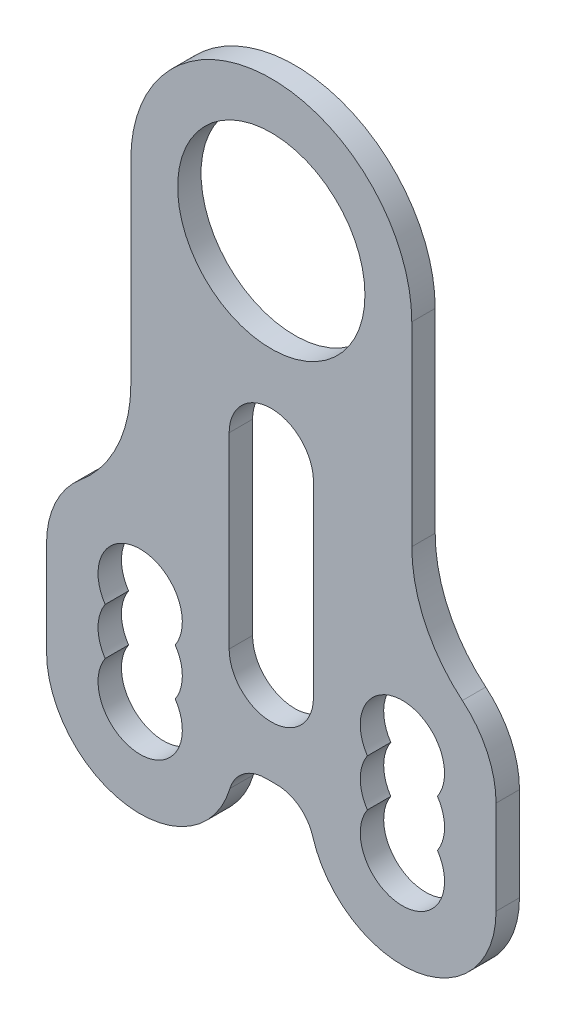
ISO-10303-21;
HEADER;
FILE_DESCRIPTION(('STEP AP214'),'2;1');
FILE_NAME('part.step','',(''),(''),'','','');
FILE_SCHEMA(('AUTOMOTIVE_DESIGN { 1 0 10303 214 1 1 1 1 }'));
ENDSEC;
DATA;
#1=APPLICATION_CONTEXT('core data for automotive mechanical design processes');
#2=APPLICATION_PROTOCOL_DEFINITION('international standard','automotive_design',2000,#1);
#3=PRODUCT_CONTEXT('',#1,'mechanical');
#4=PRODUCT('Part','Part','',(#3));
#5=PRODUCT_RELATED_PRODUCT_CATEGORY('part','',(#4));
#6=PRODUCT_DEFINITION_FORMATION('','',#4);
#7=PRODUCT_DEFINITION_CONTEXT('part definition',#1,'design');
#8=PRODUCT_DEFINITION('design','',#6,#7);
#9=PRODUCT_DEFINITION_SHAPE('','',#8);
#10=(LENGTH_UNIT() NAMED_UNIT(*) SI_UNIT(.MILLI.,.METRE.));
#11=(NAMED_UNIT(*) PLANE_ANGLE_UNIT() SI_UNIT($,.RADIAN.));
#12=(NAMED_UNIT(*) SI_UNIT($,.STERADIAN.) SOLID_ANGLE_UNIT());
#13=UNCERTAINTY_MEASURE_WITH_UNIT(LENGTH_MEASURE(1.E-05),#10,'distance_accuracy_value','');
#14=(GEOMETRIC_REPRESENTATION_CONTEXT(3) GLOBAL_UNCERTAINTY_ASSIGNED_CONTEXT((#13)) GLOBAL_UNIT_ASSIGNED_CONTEXT((#10,
#11,#12)) REPRESENTATION_CONTEXT('',''));
#15=CARTESIAN_POINT('',(0.,0.,0.));
#16=DIRECTION('',(0.,0.,1.));
#17=DIRECTION('',(1.,0.,0.));
#18=AXIS2_PLACEMENT_3D('',#15,#16,#17);
#19=CARTESIAN_POINT('',(0.583592135001261,-54.,2.5));
#20=DIRECTION('',(0.,0.,1.));
#21=DIRECTION('',(1.,0.,0.));
#22=AXIS2_PLACEMENT_3D('',#19,#20,#21);
#23=PLANE('',#22);
#24=CARTESIAN_POINT('',(0.583592135001261,-54.,2.5));
#25=DIRECTION('',(0.,0.,-1.));
#26=DIRECTION('',(1.,0.,0.));
#27=AXIS2_PLACEMENT_3D('',#24,#25,#26);
#28=CIRCLE('',#27,4.);
#29=CARTESIAN_POINT('',(0.583592135001261,-50.,2.5));
#30=VERTEX_POINT('',#29);
#31=CARTESIAN_POINT('',(4.4168515250009,-52.8571428571429,2.5));
#32=VERTEX_POINT('',#31);
#33=EDGE_CURVE('E313',#30,#32,#28,.T.);
#34=ORIENTED_EDGE('',*,*,#33,.T.);
#35=CARTESIAN_POINT('',(14.,-50.,2.5));
#36=DIRECTION('',(0.,0.,1.));
#37=DIRECTION('',(-1.,0.,0.));
#38=AXIS2_PLACEMENT_3D('',#35,#36,#37);
#39=CIRCLE('',#38,10.);
#40=CARTESIAN_POINT('',(24.,-50.0000000000001,2.5));
#41=VERTEX_POINT('',#40);
#42=EDGE_CURVE('E316',#32,#41,#39,.T.);
#43=ORIENTED_EDGE('',*,*,#42,.T.);
#44=DIRECTION('',(0.,1.,0.));
#45=VECTOR('',#44,1.);
#46=CARTESIAN_POINT('',(24.,-40.0000000000001,2.5));
#47=LINE('',#46,#45);
#48=CARTESIAN_POINT('',(24.,-40.0000000000001,2.5));
#49=VERTEX_POINT('',#48);
#50=EDGE_CURVE('E319',#41,#49,#47,.T.);
#51=ORIENTED_EDGE('',*,*,#50,.T.);
#52=CARTESIAN_POINT('',(14.,-40.,2.5));
#53=DIRECTION('',(0.,0.,1.));
#54=DIRECTION('',(-1.,0.,0.));
#55=AXIS2_PLACEMENT_3D('',#52,#53,#54);
#56=CIRCLE('',#55,10.);
#57=CARTESIAN_POINT('',(20.4,-32.3162509150806,2.5));
#58=VERTEX_POINT('',#57);
#59=EDGE_CURVE('E321',#49,#58,#56,.T.);
#60=ORIENTED_EDGE('',*,*,#59,.T.);
#61=CARTESIAN_POINT('',(30.,-20.7906272877015,2.5));
#62=DIRECTION('',(0.,0.,-1.));
#63=DIRECTION('',(-1.,0.,0.));
#64=AXIS2_PLACEMENT_3D('',#61,#62,#63);
#65=CIRCLE('',#64,15.);
#66=CARTESIAN_POINT('',(15.,-20.7906272877015,2.5));
#67=VERTEX_POINT('',#66);
#68=EDGE_CURVE('E323',#58,#67,#65,.T.);
#69=ORIENTED_EDGE('',*,*,#68,.T.);
#70=DIRECTION('',(0.,1.,0.));
#71=VECTOR('',#70,1.);
#72=CARTESIAN_POINT('',(15.,0.,2.5));
#73=LINE('',#72,#71);
#74=CARTESIAN_POINT('',(15.,0.,2.5));
#75=VERTEX_POINT('',#74);
#76=EDGE_CURVE('E325',#67,#75,#73,.T.);
#77=ORIENTED_EDGE('',*,*,#76,.T.);
#78=CARTESIAN_POINT('',(0.,0.,2.5));
#79=DIRECTION('',(0.,0.,1.));
#80=DIRECTION('',(1.,0.,0.));
#81=AXIS2_PLACEMENT_3D('',#78,#79,#80);
#82=CIRCLE('',#81,15.);
#83=CARTESIAN_POINT('',(-15.,0.,2.5));
#84=VERTEX_POINT('',#83);
#85=EDGE_CURVE('E327',#75,#84,#82,.T.);
#86=ORIENTED_EDGE('',*,*,#85,.T.);
#87=DIRECTION('',(0.,-1.,0.));
#88=VECTOR('',#87,1.);
#89=CARTESIAN_POINT('',(-15.,0.,2.5));
#90=LINE('',#89,#88);
#91=CARTESIAN_POINT('',(-15.,-20.7906272877015,2.5));
#92=VERTEX_POINT('',#91);
#93=EDGE_CURVE('E329',#84,#92,#90,.T.);
#94=ORIENTED_EDGE('',*,*,#93,.T.);
#95=CARTESIAN_POINT('',(-30.,-20.7906272877015,2.5));
#96=DIRECTION('',(0.,0.,-1.));
#97=DIRECTION('',(1.,0.,0.));
#98=AXIS2_PLACEMENT_3D('',#95,#96,#97);
#99=CIRCLE('',#98,15.);
#100=CARTESIAN_POINT('',(-20.4,-32.3162509150806,2.5));
#101=VERTEX_POINT('',#100);
#102=EDGE_CURVE('E331',#92,#101,#99,.T.);
#103=ORIENTED_EDGE('',*,*,#102,.T.);
#104=CARTESIAN_POINT('',(-14.,-40.,2.5));
#105=DIRECTION('',(0.,0.,1.));
#106=DIRECTION('',(1.,0.,0.));
#107=AXIS2_PLACEMENT_3D('',#104,#105,#106);
#108=CIRCLE('',#107,10.);
#109=CARTESIAN_POINT('',(-24.,-40.0000000000001,2.5));
#110=VERTEX_POINT('',#109);
#111=EDGE_CURVE('E333',#101,#110,#108,.T.);
#112=ORIENTED_EDGE('',*,*,#111,.T.);
#113=DIRECTION('',(0.,-1.,0.));
#114=VECTOR('',#113,1.);
#115=CARTESIAN_POINT('',(-24.,-40.0000000000001,2.5));
#116=LINE('',#115,#114);
#117=CARTESIAN_POINT('',(-24.,-50.0000000000001,2.5));
#118=VERTEX_POINT('',#117);
#119=EDGE_CURVE('E335',#110,#118,#116,.T.);
#120=ORIENTED_EDGE('',*,*,#119,.T.);
#121=CARTESIAN_POINT('',(-14.,-50.,2.5));
#122=DIRECTION('',(0.,0.,1.));
#123=DIRECTION('',(1.,0.,0.));
#124=AXIS2_PLACEMENT_3D('',#121,#122,#123);
#125=CIRCLE('',#124,10.);
#126=CARTESIAN_POINT('',(-4.4168515250009,-52.8571428571429,2.5));
#127=VERTEX_POINT('',#126);
#128=EDGE_CURVE('E337',#118,#127,#125,.T.);
#129=ORIENTED_EDGE('',*,*,#128,.T.);
#130=CARTESIAN_POINT('',(-0.583592135001261,-54.,2.5));
#131=DIRECTION('',(0.,0.,-1.));
#132=DIRECTION('',(-1.,0.,0.));
#133=AXIS2_PLACEMENT_3D('',#130,#131,#132);
#134=CIRCLE('',#133,4.);
#135=CARTESIAN_POINT('',(-0.583592135001261,-50.,2.5));
#136=VERTEX_POINT('',#135);
#137=EDGE_CURVE('E339',#127,#136,#134,.T.);
#138=ORIENTED_EDGE('',*,*,#137,.T.);
#139=DIRECTION('',(1.,0.,0.));
#140=VECTOR('',#139,1.);
#141=CARTESIAN_POINT('',(-0.583592135001261,-50.,2.5));
#142=LINE('',#141,#140);
#143=EDGE_CURVE('E341',#136,#30,#142,.T.);
#144=ORIENTED_EDGE('',*,*,#143,.T.);
#145=EDGE_LOOP('',(#34,#43,#51,#60,#69,#77,#86,#94,#103,#112,#120,#129,#138,#144));
#146=FACE_BOUND('',#145,.T.);
#147=CARTESIAN_POINT('',(0.,0.,2.5));
#148=DIRECTION('',(0.,0.,1.));
#149=DIRECTION('',(1.,0.,0.));
#150=AXIS2_PLACEMENT_3D('',#147,#148,#149);
#151=CIRCLE('',#150,10.);
#152=CARTESIAN_POINT('',(10.,0.,2.5));
#153=VERTEX_POINT('',#152);
#154=EDGE_CURVE('E307',#153,#153,#151,.T.);
#155=ORIENTED_EDGE('',*,*,#154,.F.);
#156=EDGE_LOOP('',(#155));
#157=FACE_BOUND('',#156,.T.);
#158=CARTESIAN_POINT('',(-14.,-40.,2.5));
#159=DIRECTION('',(0.,0.,1.));
#160=DIRECTION('',(1.,0.,0.));
#161=AXIS2_PLACEMENT_3D('',#158,#159,#160);
#162=CIRCLE('',#161,4.5);
#163=CARTESIAN_POINT('',(-10.2583426132261,-42.5,2.5));
#164=VERTEX_POINT('',#163);
#165=CARTESIAN_POINT('',(-17.7416573867739,-42.5,2.5));
#166=VERTEX_POINT('',#165);
#167=EDGE_CURVE('E278',#164,#166,#162,.T.);
#168=ORIENTED_EDGE('',*,*,#167,.F.);
#169=CARTESIAN_POINT('',(-14.,-45.,2.5));
#170=DIRECTION('',(0.,0.,1.));
#171=DIRECTION('',(1.,0.,0.));
#172=AXIS2_PLACEMENT_3D('',#169,#170,#171);
#173=CIRCLE('',#172,4.5);
#174=CARTESIAN_POINT('',(-10.2583426132261,-47.5,2.5));
#175=VERTEX_POINT('',#174);
#176=EDGE_CURVE('E276',#175,#164,#173,.T.);
#177=ORIENTED_EDGE('',*,*,#176,.F.);
#178=CARTESIAN_POINT('',(-14.,-50.,2.5));
#179=DIRECTION('',(0.,0.,1.));
#180=DIRECTION('',(1.,0.,0.));
#181=AXIS2_PLACEMENT_3D('',#178,#179,#180);
#182=CIRCLE('',#181,4.5);
#183=CARTESIAN_POINT('',(-17.7416573867739,-47.5,2.5));
#184=VERTEX_POINT('',#183);
#185=EDGE_CURVE('E284',#184,#175,#182,.T.);
#186=ORIENTED_EDGE('',*,*,#185,.F.);
#187=CARTESIAN_POINT('',(-14.,-45.,2.5));
#188=DIRECTION('',(0.,0.,1.));
#189=DIRECTION('',(1.,0.,0.));
#190=AXIS2_PLACEMENT_3D('',#187,#188,#189);
#191=CIRCLE('',#190,4.5);
#192=EDGE_CURVE('E281',#166,#184,#191,.T.);
#193=ORIENTED_EDGE('',*,*,#192,.F.);
#194=EDGE_LOOP('',(#168,#177,#186,#193));
#195=FACE_BOUND('',#194,.T.);
#196=CARTESIAN_POINT('',(14.,-45.,2.5));
#197=DIRECTION('',(0.,0.,1.));
#198=DIRECTION('',(-1.,0.,0.));
#199=AXIS2_PLACEMENT_3D('',#196,#197,#198);
#200=CIRCLE('',#199,4.5);
#201=CARTESIAN_POINT('',(17.7416573867739,-47.5,2.5));
#202=VERTEX_POINT('',#201);
#203=CARTESIAN_POINT('',(17.7416573867739,-42.5,2.5));
#204=VERTEX_POINT('',#203);
#205=EDGE_CURVE('E247',#202,#204,#200,.T.);
#206=ORIENTED_EDGE('',*,*,#205,.F.);
#207=CARTESIAN_POINT('',(14.,-50.,2.5));
#208=DIRECTION('',(0.,0.,1.));
#209=DIRECTION('',(-1.,0.,0.));
#210=AXIS2_PLACEMENT_3D('',#207,#208,#209);
#211=CIRCLE('',#210,4.5);
#212=CARTESIAN_POINT('',(10.2583426132261,-47.5,2.5));
#213=VERTEX_POINT('',#212);
#214=EDGE_CURVE('E245',#213,#202,#211,.T.);
#215=ORIENTED_EDGE('',*,*,#214,.F.);
#216=CARTESIAN_POINT('',(14.,-45.,2.5));
#217=DIRECTION('',(0.,0.,1.));
#218=DIRECTION('',(-1.,0.,0.));
#219=AXIS2_PLACEMENT_3D('',#216,#217,#218);
#220=CIRCLE('',#219,4.5);
#221=CARTESIAN_POINT('',(10.2583426132261,-42.5,2.5));
#222=VERTEX_POINT('',#221);
#223=EDGE_CURVE('E253',#222,#213,#220,.T.);
#224=ORIENTED_EDGE('',*,*,#223,.F.);
#225=CARTESIAN_POINT('',(14.,-40.,2.5));
#226=DIRECTION('',(0.,0.,1.));
#227=DIRECTION('',(-1.,0.,0.));
#228=AXIS2_PLACEMENT_3D('',#225,#226,#227);
#229=CIRCLE('',#228,4.5);
#230=EDGE_CURVE('E250',#204,#222,#229,.T.);
#231=ORIENTED_EDGE('',*,*,#230,.F.);
#232=EDGE_LOOP('',(#206,#215,#224,#231));
#233=FACE_BOUND('',#232,.T.);
#234=DIRECTION('',(0.,-1.,0.));
#235=VECTOR('',#234,1.);
#236=CARTESIAN_POINT('',(-4.5,-20.,2.5));
#237=LINE('',#236,#235);
#238=CARTESIAN_POINT('',(-4.5,-20.,2.5));
#239=VERTEX_POINT('',#238);
#240=CARTESIAN_POINT('',(-4.5,-40.,2.5));
#241=VERTEX_POINT('',#240);
#242=EDGE_CURVE('E217',#239,#241,#237,.T.);
#243=ORIENTED_EDGE('',*,*,#242,.F.);
#244=CARTESIAN_POINT('',(0.,-20.,2.5));
#245=DIRECTION('',(0.,0.,1.));
#246=DIRECTION('',(1.,0.,0.));
#247=AXIS2_PLACEMENT_3D('',#244,#245,#246);
#248=CIRCLE('',#247,4.5);
#249=CARTESIAN_POINT('',(4.5,-20.,2.5));
#250=VERTEX_POINT('',#249);
#251=EDGE_CURVE('E209',#250,#239,#248,.T.);
#252=ORIENTED_EDGE('',*,*,#251,.F.);
#253=DIRECTION('',(0.,1.,0.));
#254=VECTOR('',#253,1.);
#255=CARTESIAN_POINT('',(4.5,-20.,2.5));
#256=LINE('',#255,#254);
#257=CARTESIAN_POINT('',(4.5,-40.,2.5));
#258=VERTEX_POINT('',#257);
#259=EDGE_CURVE('E231',#258,#250,#256,.T.);
#260=ORIENTED_EDGE('',*,*,#259,.F.);
#261=CARTESIAN_POINT('',(0.,-40.,2.5));
#262=DIRECTION('',(0.,0.,1.));
#263=DIRECTION('',(1.,0.,0.));
#264=AXIS2_PLACEMENT_3D('',#261,#262,#263);
#265=CIRCLE('',#264,4.5);
#266=EDGE_CURVE('E229',#241,#258,#265,.T.);
#267=ORIENTED_EDGE('',*,*,#266,.F.);
#268=EDGE_LOOP('',(#243,#252,#260,#267));
#269=FACE_BOUND('',#268,.T.);
#270=ADVANCED_FACE('F36',(#146,#157,#195,#233,#269),#23,.T.);
#271=CARTESIAN_POINT('',(0.583592135001261,-54.,0.));
#272=DIRECTION('',(0.,0.,1.));
#273=DIRECTION('',(1.,0.,0.));
#274=AXIS2_PLACEMENT_3D('',#271,#272,#273);
#275=PLANE('',#274);
#276=CARTESIAN_POINT('',(14.,-50.,0.));
#277=DIRECTION('',(0.,0.,1.));
#278=DIRECTION('',(-1.,0.,0.));
#279=AXIS2_PLACEMENT_3D('',#276,#277,#278);
#280=CIRCLE('',#279,4.5);
#281=CARTESIAN_POINT('',(10.2583426132261,-47.5,0.));
#282=VERTEX_POINT('',#281);
#283=CARTESIAN_POINT('',(17.7416573867739,-47.5,0.));
#284=VERTEX_POINT('',#283);
#285=EDGE_CURVE('E225',#282,#284,#280,.T.);
#286=ORIENTED_EDGE('',*,*,#285,.T.);
#287=CARTESIAN_POINT('',(14.,-45.,0.));
#288=DIRECTION('',(0.,0.,1.));
#289=DIRECTION('',(-1.,0.,0.));
#290=AXIS2_PLACEMENT_3D('',#287,#288,#289);
#291=CIRCLE('',#290,4.5);
#292=CARTESIAN_POINT('',(17.7416573867739,-42.5,0.));
#293=VERTEX_POINT('',#292);
#294=EDGE_CURVE('E258',#284,#293,#291,.T.);
#295=ORIENTED_EDGE('',*,*,#294,.T.);
#296=CARTESIAN_POINT('',(14.,-40.,0.));
#297=DIRECTION('',(0.,0.,1.));
#298=DIRECTION('',(-1.,0.,0.));
#299=AXIS2_PLACEMENT_3D('',#296,#297,#298);
#300=CIRCLE('',#299,4.5);
#301=CARTESIAN_POINT('',(10.2583426132261,-42.5,0.));
#302=VERTEX_POINT('',#301);
#303=EDGE_CURVE('E261',#293,#302,#300,.T.);
#304=ORIENTED_EDGE('',*,*,#303,.T.);
#305=CARTESIAN_POINT('',(14.,-45.,0.));
#306=DIRECTION('',(0.,0.,1.));
#307=DIRECTION('',(-1.,0.,0.));
#308=AXIS2_PLACEMENT_3D('',#305,#306,#307);
#309=CIRCLE('',#308,4.5);
#310=EDGE_CURVE('E248',#302,#282,#309,.T.);
#311=ORIENTED_EDGE('',*,*,#310,.T.);
#312=EDGE_LOOP('',(#286,#295,#304,#311));
#313=FACE_BOUND('',#312,.T.);
#314=CARTESIAN_POINT('',(0.,0.,0.));
#315=DIRECTION('',(0.,0.,1.));
#316=DIRECTION('',(1.,0.,0.));
#317=AXIS2_PLACEMENT_3D('',#314,#315,#316);
#318=CIRCLE('',#317,10.);
#319=CARTESIAN_POINT('',(10.,0.,0.));
#320=VERTEX_POINT('',#319);
#321=EDGE_CURVE('E306',#320,#320,#318,.T.);
#322=ORIENTED_EDGE('',*,*,#321,.T.);
#323=EDGE_LOOP('',(#322));
#324=FACE_BOUND('',#323,.T.);
#325=CARTESIAN_POINT('',(0.583592135001261,-54.,0.));
#326=DIRECTION('',(0.,0.,-1.));
#327=DIRECTION('',(1.,0.,0.));
#328=AXIS2_PLACEMENT_3D('',#325,#326,#327);
#329=CIRCLE('',#328,4.);
#330=CARTESIAN_POINT('',(0.583592135001261,-50.,0.));
#331=VERTEX_POINT('',#330);
#332=CARTESIAN_POINT('',(4.4168515250009,-52.8571428571429,0.));
#333=VERTEX_POINT('',#332);
#334=EDGE_CURVE('E310',#331,#333,#329,.T.);
#335=ORIENTED_EDGE('',*,*,#334,.F.);
#336=DIRECTION('',(1.,0.,0.));
#337=VECTOR('',#336,1.);
#338=CARTESIAN_POINT('',(-0.583592135001261,-50.,0.));
#339=LINE('',#338,#337);
#340=CARTESIAN_POINT('',(-0.583592135001261,-50.,0.));
#341=VERTEX_POINT('',#340);
#342=EDGE_CURVE('E317',#341,#331,#339,.T.);
#343=ORIENTED_EDGE('',*,*,#342,.F.);
#344=CARTESIAN_POINT('',(-0.583592135001261,-54.,0.));
#345=DIRECTION('',(0.,0.,-1.));
#346=DIRECTION('',(-1.,0.,0.));
#347=AXIS2_PLACEMENT_3D('',#344,#345,#346);
#348=CIRCLE('',#347,4.);
#349=CARTESIAN_POINT('',(-4.4168515250009,-52.8571428571429,0.));
#350=VERTEX_POINT('',#349);
#351=EDGE_CURVE('E368',#350,#341,#348,.T.);
#352=ORIENTED_EDGE('',*,*,#351,.F.);
#353=CARTESIAN_POINT('',(-14.,-50.,0.));
#354=DIRECTION('',(0.,0.,1.));
#355=DIRECTION('',(1.,0.,0.));
#356=AXIS2_PLACEMENT_3D('',#353,#354,#355);
#357=CIRCLE('',#356,10.);
#358=CARTESIAN_POINT('',(-24.,-50.0000000000001,0.));
#359=VERTEX_POINT('',#358);
#360=EDGE_CURVE('E366',#359,#350,#357,.T.);
#361=ORIENTED_EDGE('',*,*,#360,.F.);
#362=DIRECTION('',(0.,-1.,0.));
#363=VECTOR('',#362,1.);
#364=CARTESIAN_POINT('',(-24.,-40.0000000000001,0.));
#365=LINE('',#364,#363);
#366=CARTESIAN_POINT('',(-24.,-40.0000000000001,0.));
#367=VERTEX_POINT('',#366);
#368=EDGE_CURVE('E364',#367,#359,#365,.T.);
#369=ORIENTED_EDGE('',*,*,#368,.F.);
#370=CARTESIAN_POINT('',(-14.,-40.,0.));
#371=DIRECTION('',(0.,0.,1.));
#372=DIRECTION('',(1.,0.,0.));
#373=AXIS2_PLACEMENT_3D('',#370,#371,#372);
#374=CIRCLE('',#373,10.);
#375=CARTESIAN_POINT('',(-20.4,-32.3162509150806,0.));
#376=VERTEX_POINT('',#375);
#377=EDGE_CURVE('E362',#376,#367,#374,.T.);
#378=ORIENTED_EDGE('',*,*,#377,.F.);
#379=CARTESIAN_POINT('',(-30.,-20.7906272877015,0.));
#380=DIRECTION('',(0.,0.,-1.));
#381=DIRECTION('',(1.,0.,0.));
#382=AXIS2_PLACEMENT_3D('',#379,#380,#381);
#383=CIRCLE('',#382,15.);
#384=CARTESIAN_POINT('',(-15.,-20.7906272877015,0.));
#385=VERTEX_POINT('',#384);
#386=EDGE_CURVE('E360',#385,#376,#383,.T.);
#387=ORIENTED_EDGE('',*,*,#386,.F.);
#388=DIRECTION('',(0.,-1.,0.));
#389=VECTOR('',#388,1.);
#390=CARTESIAN_POINT('',(-15.,0.,0.));
#391=LINE('',#390,#389);
#392=CARTESIAN_POINT('',(-15.,0.,0.));
#393=VERTEX_POINT('',#392);
#394=EDGE_CURVE('E358',#393,#385,#391,.T.);
#395=ORIENTED_EDGE('',*,*,#394,.F.);
#396=CARTESIAN_POINT('',(0.,0.,0.));
#397=DIRECTION('',(0.,0.,1.));
#398=DIRECTION('',(1.,0.,0.));
#399=AXIS2_PLACEMENT_3D('',#396,#397,#398);
#400=CIRCLE('',#399,15.);
#401=CARTESIAN_POINT('',(15.,0.,0.));
#402=VERTEX_POINT('',#401);
#403=EDGE_CURVE('E356',#402,#393,#400,.T.);
#404=ORIENTED_EDGE('',*,*,#403,.F.);
#405=DIRECTION('',(0.,1.,0.));
#406=VECTOR('',#405,1.);
#407=CARTESIAN_POINT('',(15.,0.,0.));
#408=LINE('',#407,#406);
#409=CARTESIAN_POINT('',(15.,-20.7906272877015,0.));
#410=VERTEX_POINT('',#409);
#411=EDGE_CURVE('E354',#410,#402,#408,.T.);
#412=ORIENTED_EDGE('',*,*,#411,.F.);
#413=CARTESIAN_POINT('',(30.,-20.7906272877015,0.));
#414=DIRECTION('',(0.,0.,-1.));
#415=DIRECTION('',(-1.,0.,0.));
#416=AXIS2_PLACEMENT_3D('',#413,#414,#415);
#417=CIRCLE('',#416,15.);
#418=CARTESIAN_POINT('',(20.4,-32.3162509150806,0.));
#419=VERTEX_POINT('',#418);
#420=EDGE_CURVE('E352',#419,#410,#417,.T.);
#421=ORIENTED_EDGE('',*,*,#420,.F.);
#422=CARTESIAN_POINT('',(14.,-40.,0.));
#423=DIRECTION('',(0.,0.,1.));
#424=DIRECTION('',(-1.,0.,0.));
#425=AXIS2_PLACEMENT_3D('',#422,#423,#424);
#426=CIRCLE('',#425,10.);
#427=CARTESIAN_POINT('',(24.,-40.0000000000001,0.));
#428=VERTEX_POINT('',#427);
#429=EDGE_CURVE('E350',#428,#419,#426,.T.);
#430=ORIENTED_EDGE('',*,*,#429,.F.);
#431=DIRECTION('',(0.,1.,0.));
#432=VECTOR('',#431,1.);
#433=CARTESIAN_POINT('',(24.,-40.0000000000001,0.));
#434=LINE('',#433,#432);
#435=CARTESIAN_POINT('',(24.,-50.0000000000001,0.));
#436=VERTEX_POINT('',#435);
#437=EDGE_CURVE('E348',#436,#428,#434,.T.);
#438=ORIENTED_EDGE('',*,*,#437,.F.);
#439=CARTESIAN_POINT('',(14.,-50.,0.));
#440=DIRECTION('',(0.,0.,1.));
#441=DIRECTION('',(-1.,0.,0.));
#442=AXIS2_PLACEMENT_3D('',#439,#440,#441);
#443=CIRCLE('',#442,10.);
#444=EDGE_CURVE('E346',#333,#436,#443,.T.);
#445=ORIENTED_EDGE('',*,*,#444,.F.);
#446=EDGE_LOOP('',(#335,#343,#352,#361,#369,#378,#387,#395,#404,#412,#421,#430,#438,#445));
#447=FACE_BOUND('',#446,.T.);
#448=CARTESIAN_POINT('',(-14.,-45.,0.));
#449=DIRECTION('',(0.,0.,1.));
#450=DIRECTION('',(1.,0.,0.));
#451=AXIS2_PLACEMENT_3D('',#448,#449,#450);
#452=CIRCLE('',#451,4.5);
#453=CARTESIAN_POINT('',(-10.2583426132261,-47.5,0.));
#454=VERTEX_POINT('',#453);
#455=CARTESIAN_POINT('',(-10.2583426132261,-42.5,0.));
#456=VERTEX_POINT('',#455);
#457=EDGE_CURVE('E275',#454,#456,#452,.T.);
#458=ORIENTED_EDGE('',*,*,#457,.T.);
#459=CARTESIAN_POINT('',(-14.,-40.,0.));
#460=DIRECTION('',(0.,0.,1.));
#461=DIRECTION('',(1.,0.,0.));
#462=AXIS2_PLACEMENT_3D('',#459,#460,#461);
#463=CIRCLE('',#462,4.5);
#464=CARTESIAN_POINT('',(-17.7416573867739,-42.5,0.));
#465=VERTEX_POINT('',#464);
#466=EDGE_CURVE('E289',#456,#465,#463,.T.);
#467=ORIENTED_EDGE('',*,*,#466,.T.);
#468=CARTESIAN_POINT('',(-14.,-45.,0.));
#469=DIRECTION('',(0.,0.,1.));
#470=DIRECTION('',(1.,0.,0.));
#471=AXIS2_PLACEMENT_3D('',#468,#469,#470);
#472=CIRCLE('',#471,4.5);
#473=CARTESIAN_POINT('',(-17.7416573867739,-47.5,0.));
#474=VERTEX_POINT('',#473);
#475=EDGE_CURVE('E292',#465,#474,#472,.T.);
#476=ORIENTED_EDGE('',*,*,#475,.T.);
#477=CARTESIAN_POINT('',(-14.,-50.,0.));
#478=DIRECTION('',(0.,0.,1.));
#479=DIRECTION('',(1.,0.,0.));
#480=AXIS2_PLACEMENT_3D('',#477,#478,#479);
#481=CIRCLE('',#480,4.5);
#482=EDGE_CURVE('E279',#474,#454,#481,.T.);
#483=ORIENTED_EDGE('',*,*,#482,.T.);
#484=EDGE_LOOP('',(#458,#467,#476,#483));
#485=FACE_BOUND('',#484,.T.);
#486=CARTESIAN_POINT('',(0.,-20.,0.));
#487=DIRECTION('',(0.,0.,1.));
#488=DIRECTION('',(1.,0.,0.));
#489=AXIS2_PLACEMENT_3D('',#486,#487,#488);
#490=CIRCLE('',#489,4.5);
#491=CARTESIAN_POINT('',(4.5,-20.,0.));
#492=VERTEX_POINT('',#491);
#493=CARTESIAN_POINT('',(-4.5,-20.,0.));
#494=VERTEX_POINT('',#493);
#495=EDGE_CURVE('E59',#492,#494,#490,.T.);
#496=ORIENTED_EDGE('',*,*,#495,.T.);
#497=DIRECTION('',(0.,-1.,0.));
#498=VECTOR('',#497,1.);
#499=CARTESIAN_POINT('',(-4.5,-20.,0.));
#500=LINE('',#499,#498);
#501=CARTESIAN_POINT('',(-4.5,-40.,0.));
#502=VERTEX_POINT('',#501);
#503=EDGE_CURVE('E224',#494,#502,#500,.T.);
#504=ORIENTED_EDGE('',*,*,#503,.T.);
#505=CARTESIAN_POINT('',(0.,-40.,0.));
#506=DIRECTION('',(0.,0.,1.));
#507=DIRECTION('',(1.,0.,0.));
#508=AXIS2_PLACEMENT_3D('',#505,#506,#507);
#509=CIRCLE('',#508,4.5);
#510=CARTESIAN_POINT('',(4.5,-40.,0.));
#511=VERTEX_POINT('',#510);
#512=EDGE_CURVE('E237',#502,#511,#509,.T.);
#513=ORIENTED_EDGE('',*,*,#512,.T.);
#514=DIRECTION('',(0.,1.,0.));
#515=VECTOR('',#514,1.);
#516=CARTESIAN_POINT('',(4.5,-20.,0.));
#517=LINE('',#516,#515);
#518=EDGE_CURVE('E218',#511,#492,#517,.T.);
#519=ORIENTED_EDGE('',*,*,#518,.T.);
#520=EDGE_LOOP('',(#496,#504,#513,#519));
#521=FACE_BOUND('',#520,.T.);
#522=ADVANCED_FACE('F416',(#313,#324,#447,#485,#521),#275,.F.);
#523=CARTESIAN_POINT('',(0.583592135001261,-54.,2.5));
#524=DIRECTION('',(0.,0.,-1.));
#525=DIRECTION('',(-1.,0.,0.));
#526=AXIS2_PLACEMENT_3D('',#523,#524,#525);
#527=CYLINDRICAL_SURFACE('',#526,4.);
#528=ORIENTED_EDGE('',*,*,#334,.T.);
#529=DIRECTION('',(0.,0.,-1.));
#530=VECTOR('',#529,1.);
#531=CARTESIAN_POINT('',(4.4168515250009,-52.8571428571429,2.5));
#532=LINE('',#531,#530);
#533=EDGE_CURVE('E11',#32,#333,#532,.T.);
#534=ORIENTED_EDGE('',*,*,#533,.F.);
#535=ORIENTED_EDGE('',*,*,#33,.F.);
#536=DIRECTION('',(0.,0.,-1.));
#537=VECTOR('',#536,1.);
#538=CARTESIAN_POINT('',(0.583592135001261,-50.,2.5));
#539=LINE('',#538,#537);
#540=EDGE_CURVE('E343',#30,#331,#539,.T.);
#541=ORIENTED_EDGE('',*,*,#540,.T.);
#542=EDGE_LOOP('',(#528,#534,#535,#541));
#543=FACE_BOUND('',#542,.T.);
#544=ADVANCED_FACE('F38',(#543),#527,.F.);
#545=CARTESIAN_POINT('',(14.,-50.,2.5));
#546=DIRECTION('',(0.,0.,-1.));
#547=DIRECTION('',(-1.,0.,0.));
#548=AXIS2_PLACEMENT_3D('',#545,#546,#547);
#549=CYLINDRICAL_SURFACE('',#548,10.);
#550=ORIENTED_EDGE('',*,*,#444,.T.);
#551=DIRECTION('',(0.,0.,-1.));
#552=VECTOR('',#551,1.);
#553=CARTESIAN_POINT('',(24.,-50.0000000000001,2.5));
#554=LINE('',#553,#552);
#555=EDGE_CURVE('E44',#41,#436,#554,.T.);
#556=ORIENTED_EDGE('',*,*,#555,.F.);
#557=ORIENTED_EDGE('',*,*,#42,.F.);
#558=ORIENTED_EDGE('',*,*,#533,.T.);
#559=EDGE_LOOP('',(#550,#556,#557,#558));
#560=FACE_BOUND('',#559,.T.);
#561=ADVANCED_FACE('F434',(#560),#549,.T.);
#562=CARTESIAN_POINT('',(24.,-40.0000000000001,2.5));
#563=DIRECTION('',(-1.,0.,0.));
#564=DIRECTION('',(0.,0.,1.));
#565=AXIS2_PLACEMENT_3D('',#562,#563,#564);
#566=PLANE('',#565);
#567=ORIENTED_EDGE('',*,*,#437,.T.);
#568=DIRECTION('',(0.,0.,-1.));
#569=VECTOR('',#568,1.);
#570=CARTESIAN_POINT('',(24.,-40.0000000000001,2.5));
#571=LINE('',#570,#569);
#572=EDGE_CURVE('E403',#49,#428,#571,.T.);
#573=ORIENTED_EDGE('',*,*,#572,.F.);
#574=ORIENTED_EDGE('',*,*,#50,.F.);
#575=ORIENTED_EDGE('',*,*,#555,.T.);
#576=EDGE_LOOP('',(#567,#573,#574,#575));
#577=FACE_BOUND('',#576,.T.);
#578=ADVANCED_FACE('F410',(#577),#566,.F.);
#579=CARTESIAN_POINT('',(14.,-40.,2.5));
#580=DIRECTION('',(0.,0.,-1.));
#581=DIRECTION('',(-1.,0.,0.));
#582=AXIS2_PLACEMENT_3D('',#579,#580,#581);
#583=CYLINDRICAL_SURFACE('',#582,10.);
#584=ORIENTED_EDGE('',*,*,#429,.T.);
#585=DIRECTION('',(0.,0.,-1.));
#586=VECTOR('',#585,1.);
#587=CARTESIAN_POINT('',(20.4,-32.3162509150806,2.5));
#588=LINE('',#587,#586);
#589=EDGE_CURVE('E400',#58,#419,#588,.T.);
#590=ORIENTED_EDGE('',*,*,#589,.F.);
#591=ORIENTED_EDGE('',*,*,#59,.F.);
#592=ORIENTED_EDGE('',*,*,#572,.T.);
#593=EDGE_LOOP('',(#584,#590,#591,#592));
#594=FACE_BOUND('',#593,.T.);
#595=ADVANCED_FACE('F422',(#594),#583,.T.);
#596=CARTESIAN_POINT('',(30.,-20.7906272877015,2.5));
#597=DIRECTION('',(0.,0.,-1.));
#598=DIRECTION('',(-1.,0.,0.));
#599=AXIS2_PLACEMENT_3D('',#596,#597,#598);
#600=CYLINDRICAL_SURFACE('',#599,15.);
#601=ORIENTED_EDGE('',*,*,#420,.T.);
#602=DIRECTION('',(0.,0.,-1.));
#603=VECTOR('',#602,1.);
#604=CARTESIAN_POINT('',(15.,-20.7906272877015,2.5));
#605=LINE('',#604,#603);
#606=EDGE_CURVE('E397',#67,#410,#605,.T.);
#607=ORIENTED_EDGE('',*,*,#606,.F.);
#608=ORIENTED_EDGE('',*,*,#68,.F.);
#609=ORIENTED_EDGE('',*,*,#589,.T.);
#610=EDGE_LOOP('',(#601,#607,#608,#609));
#611=FACE_BOUND('',#610,.T.);
#612=ADVANCED_FACE('F426',(#611),#600,.F.);
#613=CARTESIAN_POINT('',(15.,0.,2.5));
#614=DIRECTION('',(-1.,0.,0.));
#615=DIRECTION('',(0.,0.,1.));
#616=AXIS2_PLACEMENT_3D('',#613,#614,#615);
#617=PLANE('',#616);
#618=ORIENTED_EDGE('',*,*,#411,.T.);
#619=DIRECTION('',(0.,0.,-1.));
#620=VECTOR('',#619,1.);
#621=CARTESIAN_POINT('',(15.,0.,2.5));
#622=LINE('',#621,#620);
#623=EDGE_CURVE('E394',#75,#402,#622,.T.);
#624=ORIENTED_EDGE('',*,*,#623,.F.);
#625=ORIENTED_EDGE('',*,*,#76,.F.);
#626=ORIENTED_EDGE('',*,*,#606,.T.);
#627=EDGE_LOOP('',(#618,#624,#625,#626));
#628=FACE_BOUND('',#627,.T.);
#629=ADVANCED_FACE('F477',(#628),#617,.F.);
#630=CARTESIAN_POINT('',(0.,0.,2.5));
#631=DIRECTION('',(0.,0.,-1.));
#632=DIRECTION('',(-1.,0.,0.));
#633=AXIS2_PLACEMENT_3D('',#630,#631,#632);
#634=CYLINDRICAL_SURFACE('',#633,15.);
#635=ORIENTED_EDGE('',*,*,#403,.T.);
#636=DIRECTION('',(0.,0.,-1.));
#637=VECTOR('',#636,1.);
#638=CARTESIAN_POINT('',(-15.,0.,2.5));
#639=LINE('',#638,#637);
#640=EDGE_CURVE('E391',#84,#393,#639,.T.);
#641=ORIENTED_EDGE('',*,*,#640,.F.);
#642=ORIENTED_EDGE('',*,*,#85,.F.);
#643=ORIENTED_EDGE('',*,*,#623,.T.);
#644=EDGE_LOOP('',(#635,#641,#642,#643));
#645=FACE_BOUND('',#644,.T.);
#646=ADVANCED_FACE('F475',(#645),#634,.T.);
#647=CARTESIAN_POINT('',(-15.,0.,2.5));
#648=DIRECTION('',(1.,0.,0.));
#649=DIRECTION('',(0.,0.,-1.));
#650=AXIS2_PLACEMENT_3D('',#647,#648,#649);
#651=PLANE('',#650);
#652=ORIENTED_EDGE('',*,*,#394,.T.);
#653=DIRECTION('',(0.,0.,-1.));
#654=VECTOR('',#653,1.);
#655=CARTESIAN_POINT('',(-15.,-20.7906272877015,2.5));
#656=LINE('',#655,#654);
#657=EDGE_CURVE('E388',#92,#385,#656,.T.);
#658=ORIENTED_EDGE('',*,*,#657,.F.);
#659=ORIENTED_EDGE('',*,*,#93,.F.);
#660=ORIENTED_EDGE('',*,*,#640,.T.);
#661=EDGE_LOOP('',(#652,#658,#659,#660));
#662=FACE_BOUND('',#661,.T.);
#663=ADVANCED_FACE('F470',(#662),#651,.F.);
#664=CARTESIAN_POINT('',(-30.,-20.7906272877015,2.5));
#665=DIRECTION('',(0.,0.,-1.));
#666=DIRECTION('',(-1.,0.,0.));
#667=AXIS2_PLACEMENT_3D('',#664,#665,#666);
#668=CYLINDRICAL_SURFACE('',#667,15.);
#669=ORIENTED_EDGE('',*,*,#386,.T.);
#670=DIRECTION('',(0.,0.,-1.));
#671=VECTOR('',#670,1.);
#672=CARTESIAN_POINT('',(-20.4,-32.3162509150806,2.5));
#673=LINE('',#672,#671);
#674=EDGE_CURVE('E385',#101,#376,#673,.T.);
#675=ORIENTED_EDGE('',*,*,#674,.F.);
#676=ORIENTED_EDGE('',*,*,#102,.F.);
#677=ORIENTED_EDGE('',*,*,#657,.T.);
#678=EDGE_LOOP('',(#669,#675,#676,#677));
#679=FACE_BOUND('',#678,.T.);
#680=ADVANCED_FACE('F465',(#679),#668,.F.);
#681=CARTESIAN_POINT('',(-14.,-40.,2.5));
#682=DIRECTION('',(0.,0.,-1.));
#683=DIRECTION('',(-1.,0.,0.));
#684=AXIS2_PLACEMENT_3D('',#681,#682,#683);
#685=CYLINDRICAL_SURFACE('',#684,10.);
#686=ORIENTED_EDGE('',*,*,#377,.T.);
#687=DIRECTION('',(0.,0.,-1.));
#688=VECTOR('',#687,1.);
#689=CARTESIAN_POINT('',(-24.,-40.0000000000001,2.5));
#690=LINE('',#689,#688);
#691=EDGE_CURVE('E382',#110,#367,#690,.T.);
#692=ORIENTED_EDGE('',*,*,#691,.F.);
#693=ORIENTED_EDGE('',*,*,#111,.F.);
#694=ORIENTED_EDGE('',*,*,#674,.T.);
#695=EDGE_LOOP('',(#686,#692,#693,#694));
#696=FACE_BOUND('',#695,.T.);
#697=ADVANCED_FACE('F461',(#696),#685,.T.);
#698=CARTESIAN_POINT('',(-24.,-40.0000000000001,2.5));
#699=DIRECTION('',(1.,0.,0.));
#700=DIRECTION('',(0.,0.,-1.));
#701=AXIS2_PLACEMENT_3D('',#698,#699,#700);
#702=PLANE('',#701);
#703=ORIENTED_EDGE('',*,*,#368,.T.);
#704=DIRECTION('',(0.,0.,-1.));
#705=VECTOR('',#704,1.);
#706=CARTESIAN_POINT('',(-24.,-50.0000000000001,2.5));
#707=LINE('',#706,#705);
#708=EDGE_CURVE('E379',#118,#359,#707,.T.);
#709=ORIENTED_EDGE('',*,*,#708,.F.);
#710=ORIENTED_EDGE('',*,*,#119,.F.);
#711=ORIENTED_EDGE('',*,*,#691,.T.);
#712=EDGE_LOOP('',(#703,#709,#710,#711));
#713=FACE_BOUND('',#712,.T.);
#714=ADVANCED_FACE('F456',(#713),#702,.F.);
#715=CARTESIAN_POINT('',(-14.,-50.,2.5));
#716=DIRECTION('',(0.,0.,-1.));
#717=DIRECTION('',(-1.,0.,0.));
#718=AXIS2_PLACEMENT_3D('',#715,#716,#717);
#719=CYLINDRICAL_SURFACE('',#718,10.);
#720=ORIENTED_EDGE('',*,*,#360,.T.);
#721=DIRECTION('',(0.,0.,-1.));
#722=VECTOR('',#721,1.);
#723=CARTESIAN_POINT('',(-4.4168515250009,-52.8571428571429,2.5));
#724=LINE('',#723,#722);
#725=EDGE_CURVE('E376',#127,#350,#724,.T.);
#726=ORIENTED_EDGE('',*,*,#725,.F.);
#727=ORIENTED_EDGE('',*,*,#128,.F.);
#728=ORIENTED_EDGE('',*,*,#708,.T.);
#729=EDGE_LOOP('',(#720,#726,#727,#728));
#730=FACE_BOUND('',#729,.T.);
#731=ADVANCED_FACE('F450',(#730),#719,.T.);
#732=CARTESIAN_POINT('',(-0.583592135001261,-54.,2.5));
#733=DIRECTION('',(0.,0.,-1.));
#734=DIRECTION('',(-1.,0.,0.));
#735=AXIS2_PLACEMENT_3D('',#732,#733,#734);
#736=CYLINDRICAL_SURFACE('',#735,4.);
#737=ORIENTED_EDGE('',*,*,#351,.T.);
#738=DIRECTION('',(0.,0.,-1.));
#739=VECTOR('',#738,1.);
#740=CARTESIAN_POINT('',(-0.583592135001261,-50.,2.5));
#741=LINE('',#740,#739);
#742=EDGE_CURVE('E373',#136,#341,#741,.T.);
#743=ORIENTED_EDGE('',*,*,#742,.F.);
#744=ORIENTED_EDGE('',*,*,#137,.F.);
#745=ORIENTED_EDGE('',*,*,#725,.T.);
#746=EDGE_LOOP('',(#737,#743,#744,#745));
#747=FACE_BOUND('',#746,.T.);
#748=ADVANCED_FACE('F446',(#747),#736,.F.);
#749=CARTESIAN_POINT('',(-0.583592135001261,-50.,2.5));
#750=DIRECTION('',(0.,1.,0.));
#751=DIRECTION('',(0.,0.,1.));
#752=AXIS2_PLACEMENT_3D('',#749,#750,#751);
#753=PLANE('',#752);
#754=ORIENTED_EDGE('',*,*,#342,.T.);
#755=ORIENTED_EDGE('',*,*,#540,.F.);
#756=ORIENTED_EDGE('',*,*,#143,.F.);
#757=ORIENTED_EDGE('',*,*,#742,.T.);
#758=EDGE_LOOP('',(#754,#755,#756,#757));
#759=FACE_BOUND('',#758,.T.);
#760=ADVANCED_FACE('F441',(#759),#753,.F.);
#761=CARTESIAN_POINT('',(0.,0.,2.5));
#762=DIRECTION('',(0.,0.,-1.));
#763=DIRECTION('',(-1.,0.,0.));
#764=AXIS2_PLACEMENT_3D('',#761,#762,#763);
#765=CYLINDRICAL_SURFACE('',#764,10.);
#766=ORIENTED_EDGE('',*,*,#154,.T.);
#767=EDGE_LOOP('',(#766));
#768=FACE_BOUND('',#767,.T.);
#769=ORIENTED_EDGE('',*,*,#321,.F.);
#770=EDGE_LOOP('',(#769));
#771=FACE_BOUND('',#770,.T.);
#772=ADVANCED_FACE('F494',(#768,#771),#765,.F.);
#773=CARTESIAN_POINT('',(-14.,-45.,2.5));
#774=DIRECTION('',(0.,0.,-1.));
#775=DIRECTION('',(-1.,0.,0.));
#776=AXIS2_PLACEMENT_3D('',#773,#774,#775);
#777=CYLINDRICAL_SURFACE('',#776,4.5);
#778=ORIENTED_EDGE('',*,*,#457,.F.);
#779=DIRECTION('',(0.,0.,-1.));
#780=VECTOR('',#779,1.);
#781=CARTESIAN_POINT('',(-10.2583426132261,-47.5,2.5));
#782=LINE('',#781,#780);
#783=EDGE_CURVE('E286',#175,#454,#782,.T.);
#784=ORIENTED_EDGE('',*,*,#783,.F.);
#785=ORIENTED_EDGE('',*,*,#176,.T.);
#786=DIRECTION('',(0.,0.,-1.));
#787=VECTOR('',#786,1.);
#788=CARTESIAN_POINT('',(-10.2583426132261,-42.5,2.5));
#789=LINE('',#788,#787);
#790=EDGE_CURVE('E303',#164,#456,#789,.T.);
#791=ORIENTED_EDGE('',*,*,#790,.T.);
#792=EDGE_LOOP('',(#778,#784,#785,#791));
#793=FACE_BOUND('',#792,.T.);
#794=ADVANCED_FACE('F544',(#793),#777,.F.);
#795=CARTESIAN_POINT('',(-14.,-40.,2.5));
#796=DIRECTION('',(0.,0.,-1.));
#797=DIRECTION('',(-1.,0.,0.));
#798=AXIS2_PLACEMENT_3D('',#795,#796,#797);
#799=CYLINDRICAL_SURFACE('',#798,4.5);
#800=ORIENTED_EDGE('',*,*,#466,.F.);
#801=ORIENTED_EDGE('',*,*,#790,.F.);
#802=ORIENTED_EDGE('',*,*,#167,.T.);
#803=DIRECTION('',(0.,0.,-1.));
#804=VECTOR('',#803,1.);
#805=CARTESIAN_POINT('',(-17.7416573867739,-42.5,2.5));
#806=LINE('',#805,#804);
#807=EDGE_CURVE('E301',#166,#465,#806,.T.);
#808=ORIENTED_EDGE('',*,*,#807,.T.);
#809=EDGE_LOOP('',(#800,#801,#802,#808));
#810=FACE_BOUND('',#809,.T.);
#811=ADVANCED_FACE('F551',(#810),#799,.F.);
#812=CARTESIAN_POINT('',(-14.,-45.,2.5));
#813=DIRECTION('',(0.,0.,-1.));
#814=DIRECTION('',(-1.,0.,0.));
#815=AXIS2_PLACEMENT_3D('',#812,#813,#814);
#816=CYLINDRICAL_SURFACE('',#815,4.5);
#817=ORIENTED_EDGE('',*,*,#475,.F.);
#818=ORIENTED_EDGE('',*,*,#807,.F.);
#819=ORIENTED_EDGE('',*,*,#192,.T.);
#820=DIRECTION('',(0.,0.,-1.));
#821=VECTOR('',#820,1.);
#822=CARTESIAN_POINT('',(-17.7416573867739,-47.5,2.5));
#823=LINE('',#822,#821);
#824=EDGE_CURVE('E299',#184,#474,#823,.T.);
#825=ORIENTED_EDGE('',*,*,#824,.T.);
#826=EDGE_LOOP('',(#817,#818,#819,#825));
#827=FACE_BOUND('',#826,.T.);
#828=ADVANCED_FACE('F558',(#827),#816,.F.);
#829=CARTESIAN_POINT('',(-14.,-50.,2.5));
#830=DIRECTION('',(0.,0.,-1.));
#831=DIRECTION('',(-1.,0.,0.));
#832=AXIS2_PLACEMENT_3D('',#829,#830,#831);
#833=CYLINDRICAL_SURFACE('',#832,4.5);
#834=ORIENTED_EDGE('',*,*,#482,.F.);
#835=ORIENTED_EDGE('',*,*,#824,.F.);
#836=ORIENTED_EDGE('',*,*,#185,.T.);
#837=ORIENTED_EDGE('',*,*,#783,.T.);
#838=EDGE_LOOP('',(#834,#835,#836,#837));
#839=FACE_BOUND('',#838,.T.);
#840=ADVANCED_FACE('F566',(#839),#833,.F.);
#841=CARTESIAN_POINT('',(14.,-50.,2.5));
#842=DIRECTION('',(0.,0.,-1.));
#843=DIRECTION('',(-1.,0.,0.));
#844=AXIS2_PLACEMENT_3D('',#841,#842,#843);
#845=CYLINDRICAL_SURFACE('',#844,4.5);
#846=ORIENTED_EDGE('',*,*,#285,.F.);
#847=DIRECTION('',(0.,0.,-1.));
#848=VECTOR('',#847,1.);
#849=CARTESIAN_POINT('',(10.2583426132261,-47.5,2.5));
#850=LINE('',#849,#848);
#851=EDGE_CURVE('E255',#213,#282,#850,.T.);
#852=ORIENTED_EDGE('',*,*,#851,.F.);
#853=ORIENTED_EDGE('',*,*,#214,.T.);
#854=DIRECTION('',(0.,0.,-1.));
#855=VECTOR('',#854,1.);
#856=CARTESIAN_POINT('',(17.7416573867739,-47.5,2.5));
#857=LINE('',#856,#855);
#858=EDGE_CURVE('E272',#202,#284,#857,.T.);
#859=ORIENTED_EDGE('',*,*,#858,.T.);
#860=EDGE_LOOP('',(#846,#852,#853,#859));
#861=FACE_BOUND('',#860,.T.);
#862=ADVANCED_FACE('F574',(#861),#845,.F.);
#863=CARTESIAN_POINT('',(14.,-45.,2.5));
#864=DIRECTION('',(0.,0.,-1.));
#865=DIRECTION('',(-1.,0.,0.));
#866=AXIS2_PLACEMENT_3D('',#863,#864,#865);
#867=CYLINDRICAL_SURFACE('',#866,4.5);
#868=ORIENTED_EDGE('',*,*,#294,.F.);
#869=ORIENTED_EDGE('',*,*,#858,.F.);
#870=ORIENTED_EDGE('',*,*,#205,.T.);
#871=DIRECTION('',(0.,0.,-1.));
#872=VECTOR('',#871,1.);
#873=CARTESIAN_POINT('',(17.7416573867739,-42.5,2.5));
#874=LINE('',#873,#872);
#875=EDGE_CURVE('E270',#204,#293,#874,.T.);
#876=ORIENTED_EDGE('',*,*,#875,.T.);
#877=EDGE_LOOP('',(#868,#869,#870,#876));
#878=FACE_BOUND('',#877,.T.);
#879=ADVANCED_FACE('F582',(#878),#867,.F.);
#880=CARTESIAN_POINT('',(14.,-40.,2.5));
#881=DIRECTION('',(0.,0.,-1.));
#882=DIRECTION('',(-1.,0.,0.));
#883=AXIS2_PLACEMENT_3D('',#880,#881,#882);
#884=CYLINDRICAL_SURFACE('',#883,4.5);
#885=ORIENTED_EDGE('',*,*,#303,.F.);
#886=ORIENTED_EDGE('',*,*,#875,.F.);
#887=ORIENTED_EDGE('',*,*,#230,.T.);
#888=DIRECTION('',(0.,0.,-1.));
#889=VECTOR('',#888,1.);
#890=CARTESIAN_POINT('',(10.2583426132261,-42.5,2.5));
#891=LINE('',#890,#889);
#892=EDGE_CURVE('E268',#222,#302,#891,.T.);
#893=ORIENTED_EDGE('',*,*,#892,.T.);
#894=EDGE_LOOP('',(#885,#886,#887,#893));
#895=FACE_BOUND('',#894,.T.);
#896=ADVANCED_FACE('F590',(#895),#884,.F.);
#897=CARTESIAN_POINT('',(14.,-45.,2.5));
#898=DIRECTION('',(0.,0.,-1.));
#899=DIRECTION('',(-1.,0.,0.));
#900=AXIS2_PLACEMENT_3D('',#897,#898,#899);
#901=CYLINDRICAL_SURFACE('',#900,4.5);
#902=ORIENTED_EDGE('',*,*,#310,.F.);
#903=ORIENTED_EDGE('',*,*,#892,.F.);
#904=ORIENTED_EDGE('',*,*,#223,.T.);
#905=ORIENTED_EDGE('',*,*,#851,.T.);
#906=EDGE_LOOP('',(#902,#903,#904,#905));
#907=FACE_BOUND('',#906,.T.);
#908=ADVANCED_FACE('F598',(#907),#901,.F.);
#909=CARTESIAN_POINT('',(0.,-20.,2.5));
#910=DIRECTION('',(0.,0.,-1.));
#911=DIRECTION('',(-1.,0.,0.));
#912=AXIS2_PLACEMENT_3D('',#909,#910,#911);
#913=CYLINDRICAL_SURFACE('',#912,4.5);
#914=ORIENTED_EDGE('',*,*,#495,.F.);
#915=DIRECTION('',(0.,0.,-1.));
#916=VECTOR('',#915,1.);
#917=CARTESIAN_POINT('',(4.5,-20.,2.5));
#918=LINE('',#917,#916);
#919=EDGE_CURVE('E213',#250,#492,#918,.T.);
#920=ORIENTED_EDGE('',*,*,#919,.F.);
#921=ORIENTED_EDGE('',*,*,#251,.T.);
#922=DIRECTION('',(0.,0.,-1.));
#923=VECTOR('',#922,1.);
#924=CARTESIAN_POINT('',(-4.5,-20.,2.5));
#925=LINE('',#924,#923);
#926=EDGE_CURVE('E212',#239,#494,#925,.T.);
#927=ORIENTED_EDGE('',*,*,#926,.T.);
#928=EDGE_LOOP('',(#914,#920,#921,#927));
#929=FACE_BOUND('',#928,.T.);
#930=ADVANCED_FACE('F211',(#929),#913,.F.);
#931=CARTESIAN_POINT('',(-4.5,-20.,2.5));
#932=DIRECTION('',(1.,0.,0.));
#933=DIRECTION('',(0.,1.,0.));
#934=AXIS2_PLACEMENT_3D('',#931,#932,#933);
#935=PLANE('',#934);
#936=ORIENTED_EDGE('',*,*,#503,.F.);
#937=ORIENTED_EDGE('',*,*,#926,.F.);
#938=ORIENTED_EDGE('',*,*,#242,.T.);
#939=DIRECTION('',(0.,0.,-1.));
#940=VECTOR('',#939,1.);
#941=CARTESIAN_POINT('',(-4.5,-40.,2.5));
#942=LINE('',#941,#940);
#943=EDGE_CURVE('E226',#241,#502,#942,.T.);
#944=ORIENTED_EDGE('',*,*,#943,.T.);
#945=EDGE_LOOP('',(#936,#937,#938,#944));
#946=FACE_BOUND('',#945,.T.);
#947=ADVANCED_FACE('F221',(#946),#935,.T.);
#948=CARTESIAN_POINT('',(0.,-40.,2.5));
#949=DIRECTION('',(0.,0.,-1.));
#950=DIRECTION('',(-1.,0.,0.));
#951=AXIS2_PLACEMENT_3D('',#948,#949,#950);
#952=CYLINDRICAL_SURFACE('',#951,4.5);
#953=ORIENTED_EDGE('',*,*,#512,.F.);
#954=ORIENTED_EDGE('',*,*,#943,.F.);
#955=ORIENTED_EDGE('',*,*,#266,.T.);
#956=DIRECTION('',(0.,0.,-1.));
#957=VECTOR('',#956,1.);
#958=CARTESIAN_POINT('',(4.5,-40.,2.5));
#959=LINE('',#958,#957);
#960=EDGE_CURVE('E51',#258,#511,#959,.T.);
#961=ORIENTED_EDGE('',*,*,#960,.T.);
#962=EDGE_LOOP('',(#953,#954,#955,#961));
#963=FACE_BOUND('',#962,.T.);
#964=ADVANCED_FACE('F619',(#963),#952,.F.);
#965=CARTESIAN_POINT('',(4.5,-20.,2.5));
#966=DIRECTION('',(-1.,0.,0.));
#967=DIRECTION('',(0.,-1.,0.));
#968=AXIS2_PLACEMENT_3D('',#965,#966,#967);
#969=PLANE('',#968);
#970=ORIENTED_EDGE('',*,*,#518,.F.);
#971=ORIENTED_EDGE('',*,*,#960,.F.);
#972=ORIENTED_EDGE('',*,*,#259,.T.);
#973=ORIENTED_EDGE('',*,*,#919,.T.);
#974=EDGE_LOOP('',(#970,#971,#972,#973));
#975=FACE_BOUND('',#974,.T.);
#976=ADVANCED_FACE('F626',(#975),#969,.T.);
#977=CLOSED_SHELL('',(#270,#522,#544,#561,#578,#595,#612,#629,#646,#663,#680,#697,#714,#731,
#748,#760,#772,#794,#811,#828,#840,#862,#879,#896,#908,#930,#947,#964,#976));
#978=MANIFOLD_SOLID_BREP('B2',#977);
#979=ADVANCED_BREP_SHAPE_REPRESENTATION('',(#18,#978),#14);
#980=SHAPE_DEFINITION_REPRESENTATION(#9,#979);
ENDSEC;
END-ISO-10303-21;
